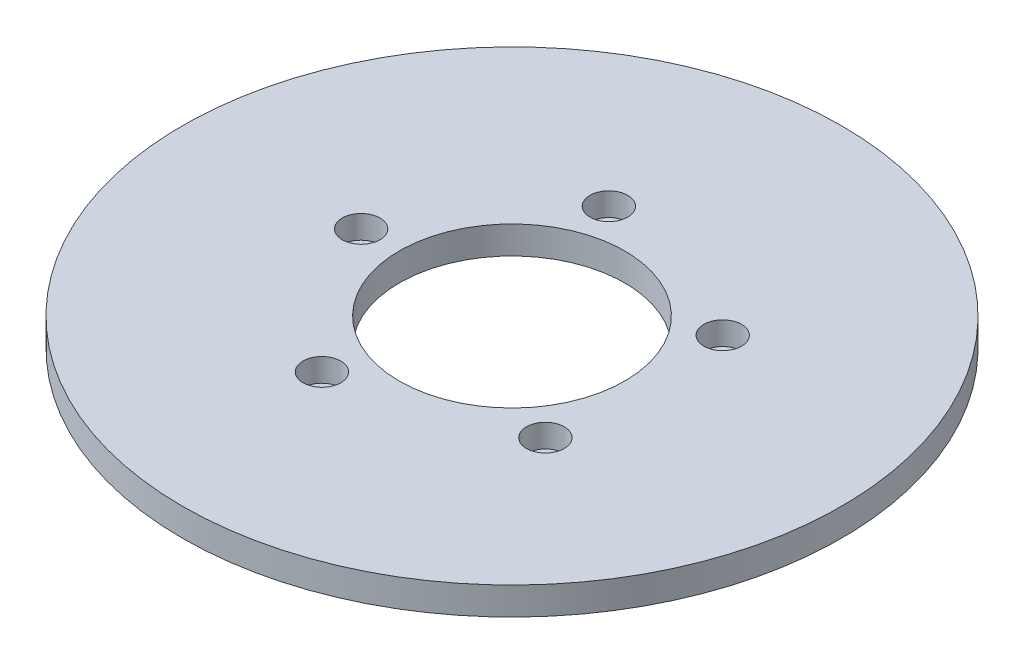
ISO-10303-21;
HEADER;
FILE_DESCRIPTION(('STEP AP214'),'2;1');
FILE_NAME('part.step','',(''),(''),'','','');
FILE_SCHEMA(('AUTOMOTIVE_DESIGN { 1 0 10303 214 1 1 1 1 }'));
ENDSEC;
DATA;
#1=APPLICATION_CONTEXT('core data for automotive mechanical design processes');
#2=APPLICATION_PROTOCOL_DEFINITION('international standard','automotive_design',2000,#1);
#3=PRODUCT_CONTEXT('',#1,'mechanical');
#4=PRODUCT('Part','Part','',(#3));
#5=PRODUCT_RELATED_PRODUCT_CATEGORY('part','',(#4));
#6=PRODUCT_DEFINITION_FORMATION('','',#4);
#7=PRODUCT_DEFINITION_CONTEXT('part definition',#1,'design');
#8=PRODUCT_DEFINITION('design','',#6,#7);
#9=PRODUCT_DEFINITION_SHAPE('','',#8);
#10=(LENGTH_UNIT() NAMED_UNIT(*) SI_UNIT(.MILLI.,.METRE.));
#11=(NAMED_UNIT(*) PLANE_ANGLE_UNIT() SI_UNIT($,.RADIAN.));
#12=(NAMED_UNIT(*) SI_UNIT($,.STERADIAN.) SOLID_ANGLE_UNIT());
#13=UNCERTAINTY_MEASURE_WITH_UNIT(LENGTH_MEASURE(1.E-05),#10,'distance_accuracy_value','');
#14=(GEOMETRIC_REPRESENTATION_CONTEXT(3) GLOBAL_UNCERTAINTY_ASSIGNED_CONTEXT((#13)) GLOBAL_UNIT_ASSIGNED_CONTEXT((#10,
#11,#12)) REPRESENTATION_CONTEXT('',''));
#15=CARTESIAN_POINT('',(0.,0.,0.));
#16=DIRECTION('',(0.,0.,1.));
#17=DIRECTION('',(1.,0.,0.));
#18=AXIS2_PLACEMENT_3D('',#15,#16,#17);
#19=CARTESIAN_POINT('',(0.,8.,0.));
#20=DIRECTION('',(0.,-1.,0.));
#21=DIRECTION('',(0.,0.,-1.));
#22=AXIS2_PLACEMENT_3D('',#19,#20,#21);
#23=CYLINDRICAL_SURFACE('',#22,95.);
#24=CARTESIAN_POINT('',(0.,8.,0.));
#25=DIRECTION('',(0.,1.,0.));
#26=DIRECTION('',(0.,0.,1.));
#27=AXIS2_PLACEMENT_3D('',#24,#25,#26);
#28=CIRCLE('',#27,95.);
#29=CARTESIAN_POINT('',(0.,8.,95.));
#30=VERTEX_POINT('',#29);
#31=EDGE_CURVE('E10',#30,#30,#28,.T.);
#32=ORIENTED_EDGE('',*,*,#31,.F.);
#33=EDGE_LOOP('',(#32));
#34=FACE_BOUND('',#33,.T.);
#35=CARTESIAN_POINT('',(0.,0.,0.));
#36=DIRECTION('',(0.,1.,0.));
#37=DIRECTION('',(0.,0.,1.));
#38=AXIS2_PLACEMENT_3D('',#35,#36,#37);
#39=CIRCLE('',#38,95.);
#40=CARTESIAN_POINT('',(0.,0.,95.));
#41=VERTEX_POINT('',#40);
#42=EDGE_CURVE('E37',#41,#41,#39,.T.);
#43=ORIENTED_EDGE('',*,*,#42,.T.);
#44=EDGE_LOOP('',(#43));
#45=FACE_BOUND('',#44,.T.);
#46=ADVANCED_FACE('F40',(#34,#45),#23,.T.);
#47=CARTESIAN_POINT('',(0.,8.,0.));
#48=DIRECTION('',(0.,1.,0.));
#49=DIRECTION('',(0.,0.,1.));
#50=AXIS2_PLACEMENT_3D('',#47,#48,#49);
#51=PLANE('',#50);
#52=CARTESIAN_POINT('',(-13.4386570788462,8.,41.3599336533089));
#53=DIRECTION('',(0.,1.,0.));
#54=DIRECTION('',(0.951056516295155,0.,0.309016994374945));
#55=AXIS2_PLACEMENT_3D('',#52,#53,#54);
#56=CIRCLE('',#55,5.44013165194661);
#57=CARTESIAN_POINT('',(-8.26478442175882,8.,43.0410267853975));
#58=VERTEX_POINT('',#57);
#59=EDGE_CURVE('E78',#58,#58,#56,.T.);
#60=ORIENTED_EDGE('',*,*,#59,.F.);
#61=EDGE_LOOP('',(#60));
#62=FACE_BOUND('',#61,.T.);
#63=CARTESIAN_POINT('',(35.1828609955741,8.,25.5618447701853));
#64=DIRECTION('',(0.,1.,0.));
#65=DIRECTION('',(0.587785252292469,0.,-0.809016994374951));
#66=AXIS2_PLACEMENT_3D('',#63,#64,#65);
#67=CIRCLE('',#66,5.44013165194661);
#68=CARTESIAN_POINT('',(38.3804901511178,8.,21.1606858121234));
#69=VERTEX_POINT('',#68);
#70=EDGE_CURVE('E71',#69,#69,#67,.T.);
#71=ORIENTED_EDGE('',*,*,#70,.F.);
#72=EDGE_LOOP('',(#71));
#73=FACE_BOUND('',#72,.T.);
#74=CARTESIAN_POINT('',(35.1828609955737,8.,-25.5618447701858));
#75=DIRECTION('',(0.,1.,0.));
#76=DIRECTION('',(-0.58778525229248,0.,-0.809016994374942));
#77=AXIS2_PLACEMENT_3D('',#74,#75,#76);
#78=CIRCLE('',#77,5.44013165194661);
#79=CARTESIAN_POINT('',(31.98523184003,8.,-29.9630037282476));
#80=VERTEX_POINT('',#79);
#81=EDGE_CURVE('E70',#80,#80,#78,.T.);
#82=ORIENTED_EDGE('',*,*,#81,.F.);
#83=EDGE_LOOP('',(#82));
#84=FACE_BOUND('',#83,.T.);
#85=CARTESIAN_POINT('',(-13.4386570788468,8.,-41.3599336533087));
#86=DIRECTION('',(0.,1.,0.));
#87=DIRECTION('',(-0.95105651629515,0.,0.309016994374958));
#88=AXIS2_PLACEMENT_3D('',#85,#86,#87);
#89=CIRCLE('',#88,5.44013165194661);
#90=CARTESIAN_POINT('',(-18.6125297359341,8.,-39.6788405212201));
#91=VERTEX_POINT('',#90);
#92=EDGE_CURVE('E61',#91,#91,#89,.T.);
#93=ORIENTED_EDGE('',*,*,#92,.F.);
#94=EDGE_LOOP('',(#93));
#95=FACE_BOUND('',#94,.T.);
#96=CARTESIAN_POINT('',(-43.4884078334553,8.,0.));
#97=DIRECTION('',(0.,1.,0.));
#98=DIRECTION('',(0.,0.,1.));
#99=AXIS2_PLACEMENT_3D('',#96,#97,#98);
#100=CIRCLE('',#99,5.44013165194661);
#101=CARTESIAN_POINT('',(-43.4884078334553,8.,5.44013165194661));
#102=VERTEX_POINT('',#101);
#103=EDGE_CURVE('E54',#102,#102,#100,.T.);
#104=ORIENTED_EDGE('',*,*,#103,.F.);
#105=EDGE_LOOP('',(#104));
#106=FACE_BOUND('',#105,.T.);
#107=CARTESIAN_POINT('',(0.,8.,0.));
#108=DIRECTION('',(0.,1.,0.));
#109=DIRECTION('',(0.,0.,1.));
#110=AXIS2_PLACEMENT_3D('',#107,#108,#109);
#111=CIRCLE('',#110,32.5);
#112=CARTESIAN_POINT('',(0.,8.,32.5));
#113=VERTEX_POINT('',#112);
#114=EDGE_CURVE('E50',#113,#113,#111,.T.);
#115=ORIENTED_EDGE('',*,*,#114,.F.);
#116=EDGE_LOOP('',(#115));
#117=FACE_BOUND('',#116,.T.);
#118=ORIENTED_EDGE('',*,*,#31,.T.);
#119=EDGE_LOOP('',(#118));
#120=FACE_BOUND('',#119,.T.);
#121=ADVANCED_FACE('F94',(#62,#73,#84,#95,#106,#117,#120),#51,.T.);
#122=CARTESIAN_POINT('',(0.,0.,0.));
#123=DIRECTION('',(0.,1.,0.));
#124=DIRECTION('',(0.,0.,1.));
#125=AXIS2_PLACEMENT_3D('',#122,#123,#124);
#126=PLANE('',#125);
#127=CARTESIAN_POINT('',(0.,0.,0.));
#128=DIRECTION('',(0.,1.,0.));
#129=DIRECTION('',(0.,0.,1.));
#130=AXIS2_PLACEMENT_3D('',#127,#128,#129);
#131=CIRCLE('',#130,32.5);
#132=CARTESIAN_POINT('',(0.,0.,32.5));
#133=VERTEX_POINT('',#132);
#134=EDGE_CURVE('E47',#133,#133,#131,.T.);
#135=ORIENTED_EDGE('',*,*,#134,.T.);
#136=EDGE_LOOP('',(#135));
#137=FACE_BOUND('',#136,.T.);
#138=ORIENTED_EDGE('',*,*,#42,.F.);
#139=EDGE_LOOP('',(#138));
#140=FACE_BOUND('',#139,.T.);
#141=ADVANCED_FACE('F100',(#137,#140),#126,.F.);
#142=CARTESIAN_POINT('',(0.,8.,0.));
#143=DIRECTION('',(0.,-1.,0.));
#144=DIRECTION('',(0.,0.,-1.));
#145=AXIS2_PLACEMENT_3D('',#142,#143,#144);
#146=CYLINDRICAL_SURFACE('',#145,32.5);
#147=ORIENTED_EDGE('',*,*,#114,.T.);
#148=EDGE_LOOP('',(#147));
#149=FACE_BOUND('',#148,.T.);
#150=ORIENTED_EDGE('',*,*,#134,.F.);
#151=EDGE_LOOP('',(#150));
#152=FACE_BOUND('',#151,.T.);
#153=ADVANCED_FACE('F108',(#149,#152),#146,.F.);
#154=CARTESIAN_POINT('',(-43.4884078334553,1.32426592409784,0.));
#155=DIRECTION('',(0.,1.,0.));
#156=DIRECTION('',(0.,0.,1.));
#157=AXIS2_PLACEMENT_3D('',#154,#155,#156);
#158=CYLINDRICAL_SURFACE('',#157,5.44013165194661);
#159=CARTESIAN_POINT('',(-43.4884078334553,1.32426592409784,0.));
#160=DIRECTION('',(0.,1.,0.));
#161=DIRECTION('',(0.,0.,1.));
#162=AXIS2_PLACEMENT_3D('',#159,#160,#161);
#163=CIRCLE('',#162,5.44013165194661);
#164=CARTESIAN_POINT('',(-43.4884078334553,1.32426592409784,5.44013165194661));
#165=VERTEX_POINT('',#164);
#166=EDGE_CURVE('E55',#165,#165,#163,.T.);
#167=ORIENTED_EDGE('',*,*,#166,.F.);
#168=EDGE_LOOP('',(#167));
#169=FACE_BOUND('',#168,.T.);
#170=ORIENTED_EDGE('',*,*,#103,.T.);
#171=EDGE_LOOP('',(#170));
#172=FACE_BOUND('',#171,.T.);
#173=ADVANCED_FACE('F115',(#169,#172),#158,.F.);
#174=CARTESIAN_POINT('',(-43.4884078334553,1.32426592409784,0.));
#175=DIRECTION('',(0.,1.,0.));
#176=DIRECTION('',(0.,0.,1.));
#177=AXIS2_PLACEMENT_3D('',#174,#175,#176);
#178=PLANE('',#177);
#179=ORIENTED_EDGE('',*,*,#166,.T.);
#180=EDGE_LOOP('',(#179));
#181=FACE_BOUND('',#180,.T.);
#182=ADVANCED_FACE('F142',(#181),#178,.T.);
#183=CARTESIAN_POINT('',(-13.4386570788468,1.32426592409784,-41.3599336533087));
#184=DIRECTION('',(0.,1.,0.));
#185=DIRECTION('',(0.,0.,1.));
#186=AXIS2_PLACEMENT_3D('',#183,#184,#185);
#187=CYLINDRICAL_SURFACE('',#186,5.44013165194661);
#188=CARTESIAN_POINT('',(-13.4386570788468,1.32426592409784,-41.3599336533087));
#189=DIRECTION('',(0.,1.,0.));
#190=DIRECTION('',(-0.95105651629515,0.,0.309016994374958));
#191=AXIS2_PLACEMENT_3D('',#188,#189,#190);
#192=CIRCLE('',#191,5.44013165194661);
#193=CARTESIAN_POINT('',(-18.6125297359341,1.32426592409784,-39.6788405212201));
#194=VERTEX_POINT('',#193);
#195=EDGE_CURVE('E63',#194,#194,#192,.T.);
#196=ORIENTED_EDGE('',*,*,#195,.F.);
#197=EDGE_LOOP('',(#196));
#198=FACE_BOUND('',#197,.T.);
#199=ORIENTED_EDGE('',*,*,#92,.T.);
#200=EDGE_LOOP('',(#199));
#201=FACE_BOUND('',#200,.T.);
#202=ADVANCED_FACE('F147',(#198,#201),#187,.F.);
#203=CARTESIAN_POINT('',(-13.4386570788468,1.32426592409784,-41.3599336533087));
#204=DIRECTION('',(0.,1.,0.));
#205=DIRECTION('',(-0.95105651629515,0.,0.309016994374958));
#206=AXIS2_PLACEMENT_3D('',#203,#204,#205);
#207=PLANE('',#206);
#208=ORIENTED_EDGE('',*,*,#195,.T.);
#209=EDGE_LOOP('',(#208));
#210=FACE_BOUND('',#209,.T.);
#211=ADVANCED_FACE('F163',(#210),#207,.T.);
#212=CARTESIAN_POINT('',(35.1828609955737,1.32426592409784,-25.5618447701858));
#213=DIRECTION('',(0.,1.,0.));
#214=DIRECTION('',(0.,0.,1.));
#215=AXIS2_PLACEMENT_3D('',#212,#213,#214);
#216=CYLINDRICAL_SURFACE('',#215,5.44013165194661);
#217=CARTESIAN_POINT('',(35.1828609955737,1.32426592409784,-25.5618447701858));
#218=DIRECTION('',(0.,1.,0.));
#219=DIRECTION('',(-0.58778525229248,0.,-0.809016994374942));
#220=AXIS2_PLACEMENT_3D('',#217,#218,#219);
#221=CIRCLE('',#220,5.44013165194661);
#222=CARTESIAN_POINT('',(31.98523184003,1.32426592409784,-29.9630037282476));
#223=VERTEX_POINT('',#222);
#224=EDGE_CURVE('E69',#223,#223,#221,.T.);
#225=ORIENTED_EDGE('',*,*,#224,.F.);
#226=EDGE_LOOP('',(#225));
#227=FACE_BOUND('',#226,.T.);
#228=ORIENTED_EDGE('',*,*,#81,.T.);
#229=EDGE_LOOP('',(#228));
#230=FACE_BOUND('',#229,.T.);
#231=ADVANCED_FACE('F172',(#227,#230),#216,.F.);
#232=CARTESIAN_POINT('',(35.1828609955737,1.32426592409784,-25.5618447701858));
#233=DIRECTION('',(0.,1.,0.));
#234=DIRECTION('',(-0.58778525229248,0.,-0.809016994374942));
#235=AXIS2_PLACEMENT_3D('',#232,#233,#234);
#236=PLANE('',#235);
#237=ORIENTED_EDGE('',*,*,#224,.T.);
#238=EDGE_LOOP('',(#237));
#239=FACE_BOUND('',#238,.T.);
#240=ADVANCED_FACE('F185',(#239),#236,.T.);
#241=CARTESIAN_POINT('',(35.1828609955741,1.32426592409784,25.5618447701853));
#242=DIRECTION('',(0.,1.,0.));
#243=DIRECTION('',(0.,0.,1.));
#244=AXIS2_PLACEMENT_3D('',#241,#242,#243);
#245=CYLINDRICAL_SURFACE('',#244,5.44013165194661);
#246=CARTESIAN_POINT('',(35.1828609955741,1.32426592409784,25.5618447701853));
#247=DIRECTION('',(0.,1.,0.));
#248=DIRECTION('',(0.587785252292469,0.,-0.809016994374951));
#249=AXIS2_PLACEMENT_3D('',#246,#247,#248);
#250=CIRCLE('',#249,5.44013165194661);
#251=CARTESIAN_POINT('',(38.3804901511178,1.32426592409784,21.1606858121234));
#252=VERTEX_POINT('',#251);
#253=EDGE_CURVE('E76',#252,#252,#250,.T.);
#254=ORIENTED_EDGE('',*,*,#253,.F.);
#255=EDGE_LOOP('',(#254));
#256=FACE_BOUND('',#255,.T.);
#257=ORIENTED_EDGE('',*,*,#70,.T.);
#258=EDGE_LOOP('',(#257));
#259=FACE_BOUND('',#258,.T.);
#260=ADVANCED_FACE('F191',(#256,#259),#245,.F.);
#261=CARTESIAN_POINT('',(35.1828609955741,1.32426592409784,25.5618447701853));
#262=DIRECTION('',(0.,1.,0.));
#263=DIRECTION('',(0.587785252292469,0.,-0.809016994374951));
#264=AXIS2_PLACEMENT_3D('',#261,#262,#263);
#265=PLANE('',#264);
#266=ORIENTED_EDGE('',*,*,#253,.T.);
#267=EDGE_LOOP('',(#266));
#268=FACE_BOUND('',#267,.T.);
#269=ADVANCED_FACE('F89',(#268),#265,.T.);
#270=CARTESIAN_POINT('',(-13.4386570788462,1.32426592409784,41.3599336533089));
#271=DIRECTION('',(0.,1.,0.));
#272=DIRECTION('',(0.,0.,1.));
#273=AXIS2_PLACEMENT_3D('',#270,#271,#272);
#274=CYLINDRICAL_SURFACE('',#273,5.44013165194661);
#275=CARTESIAN_POINT('',(-13.4386570788462,1.32426592409784,41.3599336533089));
#276=DIRECTION('',(0.,1.,0.));
#277=DIRECTION('',(0.951056516295155,0.,0.309016994374945));
#278=AXIS2_PLACEMENT_3D('',#275,#276,#277);
#279=CIRCLE('',#278,5.44013165194661);
#280=CARTESIAN_POINT('',(-8.26478442175882,1.32426592409784,43.0410267853975));
#281=VERTEX_POINT('',#280);
#282=EDGE_CURVE('E59',#281,#281,#279,.T.);
#283=ORIENTED_EDGE('',*,*,#282,.F.);
#284=EDGE_LOOP('',(#283));
#285=FACE_BOUND('',#284,.T.);
#286=ORIENTED_EDGE('',*,*,#59,.T.);
#287=EDGE_LOOP('',(#286));
#288=FACE_BOUND('',#287,.T.);
#289=ADVANCED_FACE('F87',(#285,#288),#274,.F.);
#290=CARTESIAN_POINT('',(-13.4386570788462,1.32426592409784,41.3599336533089));
#291=DIRECTION('',(0.,1.,0.));
#292=DIRECTION('',(0.951056516295155,0.,0.309016994374945));
#293=AXIS2_PLACEMENT_3D('',#290,#291,#292);
#294=PLANE('',#293);
#295=ORIENTED_EDGE('',*,*,#282,.T.);
#296=EDGE_LOOP('',(#295));
#297=FACE_BOUND('',#296,.T.);
#298=ADVANCED_FACE('F84',(#297),#294,.T.);
#299=CLOSED_SHELL('',(#46,#121,#141,#153,#173,#182,#202,#211,#231,#240,#260,#269,#289,#298));
#300=MANIFOLD_SOLID_BREP('B2',#299);
#301=ADVANCED_BREP_SHAPE_REPRESENTATION('',(#18,#300),#14);
#302=SHAPE_DEFINITION_REPRESENTATION(#9,#301);
ENDSEC;
END-ISO-10303-21;
